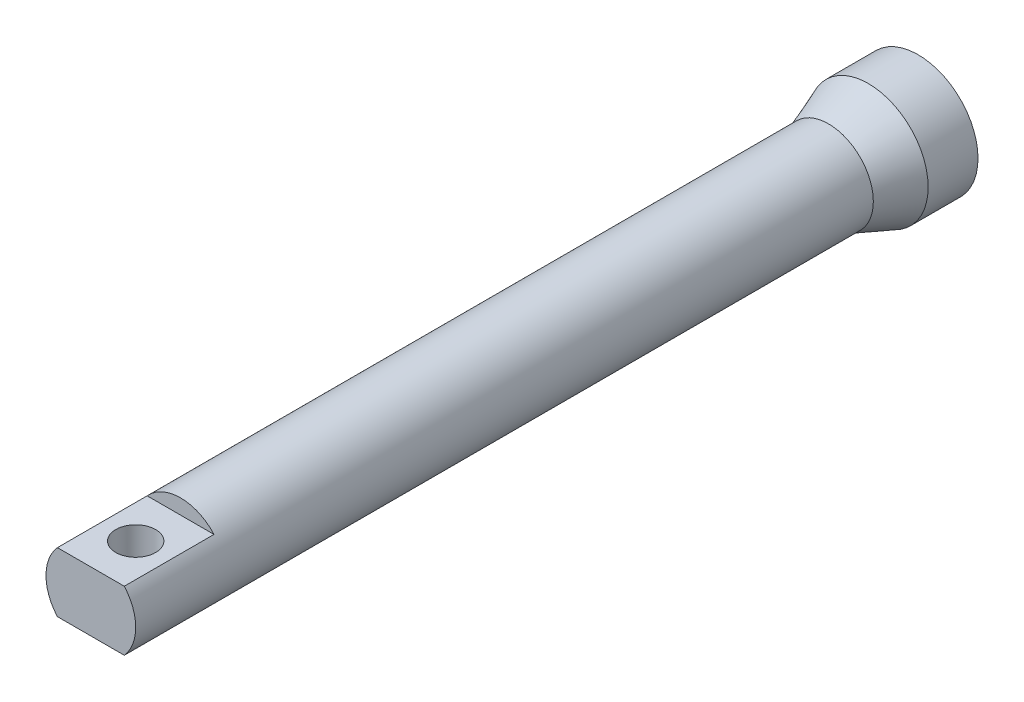
ISO-10303-21;
HEADER;
FILE_DESCRIPTION(('STEP AP214'),'2;1');
FILE_NAME('part.step','',(''),(''),'','','');
FILE_SCHEMA(('AUTOMOTIVE_DESIGN { 1 0 10303 214 1 1 1 1 }'));
ENDSEC;
DATA;
#1=APPLICATION_CONTEXT('core data for automotive mechanical design processes');
#2=APPLICATION_PROTOCOL_DEFINITION('international standard','automotive_design',2000,#1);
#3=PRODUCT_CONTEXT('',#1,'mechanical');
#4=PRODUCT('Part','Part','',(#3));
#5=PRODUCT_RELATED_PRODUCT_CATEGORY('part','',(#4));
#6=PRODUCT_DEFINITION_FORMATION('','',#4);
#7=PRODUCT_DEFINITION_CONTEXT('part definition',#1,'design');
#8=PRODUCT_DEFINITION('design','',#6,#7);
#9=PRODUCT_DEFINITION_SHAPE('','',#8);
#10=(LENGTH_UNIT() NAMED_UNIT(*) SI_UNIT(.MILLI.,.METRE.));
#11=(NAMED_UNIT(*) PLANE_ANGLE_UNIT() SI_UNIT($,.RADIAN.));
#12=(NAMED_UNIT(*) SI_UNIT($,.STERADIAN.) SOLID_ANGLE_UNIT());
#13=UNCERTAINTY_MEASURE_WITH_UNIT(LENGTH_MEASURE(1.E-05),#10,'distance_accuracy_value','');
#14=(GEOMETRIC_REPRESENTATION_CONTEXT(3) GLOBAL_UNCERTAINTY_ASSIGNED_CONTEXT((#13)) GLOBAL_UNIT_ASSIGNED_CONTEXT((#10,
#11,#12)) REPRESENTATION_CONTEXT('',''));
#15=CARTESIAN_POINT('',(0.,0.,0.));
#16=DIRECTION('',(0.,0.,1.));
#17=DIRECTION('',(1.,0.,0.));
#18=AXIS2_PLACEMENT_3D('',#15,#16,#17);
#19=CARTESIAN_POINT('',(-30.,0.,0.));
#20=DIRECTION('',(0.,0.,1.));
#21=DIRECTION('',(1.,0.,0.));
#22=AXIS2_PLACEMENT_3D('',#19,#20,#21);
#23=PLANE('',#22);
#24=CARTESIAN_POINT('',(0.,0.,0.));
#25=DIRECTION('',(0.,0.,1.));
#26=DIRECTION('',(1.,0.,0.));
#27=AXIS2_PLACEMENT_3D('',#24,#25,#26);
#28=CIRCLE('',#27,30.);
#29=CARTESIAN_POINT('',(30.,0.,0.));
#30=VERTEX_POINT('',#29);
#31=EDGE_CURVE('E117',#30,#30,#28,.T.);
#32=ORIENTED_EDGE('',*,*,#31,.F.);
#33=EDGE_LOOP('',(#32));
#34=FACE_BOUND('',#33,.T.);
#35=CARTESIAN_POINT('',(0.,0.,0.));
#36=DIRECTION('',(0.,0.,1.));
#37=DIRECTION('',(1.,0.,0.));
#38=AXIS2_PLACEMENT_3D('',#35,#36,#37);
#39=CIRCLE('',#38,25.);
#40=CARTESIAN_POINT('',(25.,0.,0.));
#41=VERTEX_POINT('',#40);
#42=EDGE_CURVE('E129',#41,#41,#39,.T.);
#43=ORIENTED_EDGE('',*,*,#42,.T.);
#44=EDGE_LOOP('',(#43));
#45=FACE_BOUND('',#44,.T.);
#46=ADVANCED_FACE('F39',(#34,#45),#23,.F.);
#47=CARTESIAN_POINT('',(0.,0.,47.25));
#48=DIRECTION('',(0.,0.,1.));
#49=DIRECTION('',(1.,0.,0.));
#50=AXIS2_PLACEMENT_3D('',#47,#48,#49);
#51=CYLINDRICAL_SURFACE('',#50,25.);
#52=ORIENTED_EDGE('',*,*,#42,.F.);
#53=EDGE_LOOP('',(#52));
#54=FACE_BOUND('',#53,.T.);
#55=CARTESIAN_POINT('',(0.,0.,25.));
#56=DIRECTION('',(0.,0.,1.));
#57=DIRECTION('',(1.,0.,0.));
#58=AXIS2_PLACEMENT_3D('',#55,#56,#57);
#59=CIRCLE('',#58,25.);
#60=CARTESIAN_POINT('',(25.,0.,25.));
#61=VERTEX_POINT('',#60);
#62=EDGE_CURVE('E126',#61,#61,#59,.T.);
#63=ORIENTED_EDGE('',*,*,#62,.T.);
#64=EDGE_LOOP('',(#63));
#65=FACE_BOUND('',#64,.T.);
#66=ADVANCED_FACE('F158',(#54,#65),#51,.F.);
#67=CARTESIAN_POINT('',(0.,0.,45.));
#68=DIRECTION('',(0.,0.,-1.));
#69=DIRECTION('',(-1.,0.,0.));
#70=AXIS2_PLACEMENT_3D('',#67,#68,#69);
#71=CONICAL_SURFACE('',#70,17.5,0.358770670270572);
#72=ORIENTED_EDGE('',*,*,#62,.F.);
#73=EDGE_LOOP('',(#72));
#74=FACE_BOUND('',#73,.T.);
#75=CARTESIAN_POINT('',(0.,0.,45.));
#76=DIRECTION('',(0.,0.,1.));
#77=DIRECTION('',(1.,0.,0.));
#78=AXIS2_PLACEMENT_3D('',#75,#76,#77);
#79=CIRCLE('',#78,17.5);
#80=CARTESIAN_POINT('',(17.5,0.,45.));
#81=VERTEX_POINT('',#80);
#82=EDGE_CURVE('E114',#81,#81,#79,.T.);
#83=ORIENTED_EDGE('',*,*,#82,.T.);
#84=EDGE_LOOP('',(#83));
#85=FACE_BOUND('',#84,.T.);
#86=ADVANCED_FACE('F163',(#74,#85),#71,.F.);
#87=CARTESIAN_POINT('',(0.,0.,25.));
#88=DIRECTION('',(0.,0.,-1.));
#89=DIRECTION('',(-1.,0.,0.));
#90=AXIS2_PLACEMENT_3D('',#87,#88,#89);
#91=CONICAL_SURFACE('',#90,30.,0.358770670270572);
#92=CARTESIAN_POINT('',(0.,0.,45.));
#93=DIRECTION('',(0.,0.,1.));
#94=DIRECTION('',(1.,0.,0.));
#95=AXIS2_PLACEMENT_3D('',#92,#93,#94);
#96=CIRCLE('',#95,22.5);
#97=CARTESIAN_POINT('',(22.5,0.,45.));
#98=VERTEX_POINT('',#97);
#99=EDGE_CURVE('E123',#98,#98,#96,.T.);
#100=ORIENTED_EDGE('',*,*,#99,.F.);
#101=EDGE_LOOP('',(#100));
#102=FACE_BOUND('',#101,.T.);
#103=CARTESIAN_POINT('',(0.,0.,25.));
#104=DIRECTION('',(0.,0.,1.));
#105=DIRECTION('',(1.,0.,0.));
#106=AXIS2_PLACEMENT_3D('',#103,#104,#105);
#107=CIRCLE('',#106,30.);
#108=CARTESIAN_POINT('',(30.,0.,25.));
#109=VERTEX_POINT('',#108);
#110=EDGE_CURVE('E120',#109,#109,#107,.T.);
#111=ORIENTED_EDGE('',*,*,#110,.T.);
#112=EDGE_LOOP('',(#111));
#113=FACE_BOUND('',#112,.T.);
#114=ADVANCED_FACE('F173',(#102,#113),#91,.T.);
#115=CARTESIAN_POINT('',(0.,0.,47.25));
#116=DIRECTION('',(0.,0.,1.));
#117=DIRECTION('',(1.,0.,0.));
#118=AXIS2_PLACEMENT_3D('',#115,#116,#117);
#119=CYLINDRICAL_SURFACE('',#118,30.);
#120=ORIENTED_EDGE('',*,*,#110,.F.);
#121=EDGE_LOOP('',(#120));
#122=FACE_BOUND('',#121,.T.);
#123=ORIENTED_EDGE('',*,*,#31,.T.);
#124=EDGE_LOOP('',(#123));
#125=FACE_BOUND('',#124,.T.);
#126=ADVANCED_FACE('F188',(#122,#125),#119,.T.);
#127=CARTESIAN_POINT('',(0.,0.,365.));
#128=DIRECTION('',(0.,0.,-1.));
#129=DIRECTION('',(-1.,0.,0.));
#130=AXIS2_PLACEMENT_3D('',#127,#128,#129);
#131=CYLINDRICAL_SURFACE('',#130,22.5);
#132=CARTESIAN_POINT('',(0.,0.,370.));
#133=DIRECTION('',(0.,0.,1.));
#134=DIRECTION('',(1.,0.,0.));
#135=AXIS2_PLACEMENT_3D('',#132,#133,#134);
#136=CIRCLE('',#135,22.5);
#137=CARTESIAN_POINT('',(16.7705098312484,15.,370.));
#138=VERTEX_POINT('',#137);
#139=CARTESIAN_POINT('',(-16.7705098312484,15.,370.));
#140=VERTEX_POINT('',#139);
#141=EDGE_CURVE('E11',#138,#140,#136,.T.);
#142=ORIENTED_EDGE('',*,*,#141,.F.);
#143=DIRECTION('',(0.,0.,1.));
#144=VECTOR('',#143,1.);
#145=CARTESIAN_POINT('',(16.7705098312484,15.,370.));
#146=LINE('',#145,#144);
#147=CARTESIAN_POINT('',(16.7705098312484,15.,415.));
#148=VERTEX_POINT('',#147);
#149=EDGE_CURVE('E86',#138,#148,#146,.T.);
#150=ORIENTED_EDGE('',*,*,#149,.T.);
#151=CARTESIAN_POINT('',(0.,0.,415.));
#152=DIRECTION('',(0.,0.,1.));
#153=DIRECTION('',(1.,0.,0.));
#154=AXIS2_PLACEMENT_3D('',#151,#152,#153);
#155=CIRCLE('',#154,22.5);
#156=CARTESIAN_POINT('',(16.7705098312484,-15.,415.));
#157=VERTEX_POINT('',#156);
#158=EDGE_CURVE('E96',#157,#148,#155,.T.);
#159=ORIENTED_EDGE('',*,*,#158,.F.);
#160=DIRECTION('',(0.,0.,1.));
#161=VECTOR('',#160,1.);
#162=CARTESIAN_POINT('',(16.7705098312484,-15.,370.));
#163=LINE('',#162,#161);
#164=CARTESIAN_POINT('',(16.7705098312484,-15.,370.));
#165=VERTEX_POINT('',#164);
#166=EDGE_CURVE('E54',#165,#157,#163,.T.);
#167=ORIENTED_EDGE('',*,*,#166,.F.);
#168=CARTESIAN_POINT('',(0.,0.,370.));
#169=DIRECTION('',(0.,0.,-1.));
#170=DIRECTION('',(-1.,0.,0.));
#171=AXIS2_PLACEMENT_3D('',#168,#169,#170);
#172=CIRCLE('',#171,22.5);
#173=CARTESIAN_POINT('',(-16.7705098312484,-15.,370.));
#174=VERTEX_POINT('',#173);
#175=EDGE_CURVE('E47',#165,#174,#172,.T.);
#176=ORIENTED_EDGE('',*,*,#175,.T.);
#177=DIRECTION('',(0.,0.,1.));
#178=VECTOR('',#177,1.);
#179=CARTESIAN_POINT('',(-16.7705098312484,-15.,370.));
#180=LINE('',#179,#178);
#181=CARTESIAN_POINT('',(-16.7705098312484,-15.,415.));
#182=VERTEX_POINT('',#181);
#183=EDGE_CURVE('E106',#174,#182,#180,.T.);
#184=ORIENTED_EDGE('',*,*,#183,.T.);
#185=CARTESIAN_POINT('',(-16.7705098312484,15.,415.));
#186=VERTEX_POINT('',#185);
#187=EDGE_CURVE('E94',#186,#182,#155,.T.);
#188=ORIENTED_EDGE('',*,*,#187,.F.);
#189=DIRECTION('',(0.,0.,1.));
#190=VECTOR('',#189,1.);
#191=CARTESIAN_POINT('',(-16.7705098312484,15.,370.));
#192=LINE('',#191,#190);
#193=EDGE_CURVE('E62',#140,#186,#192,.T.);
#194=ORIENTED_EDGE('',*,*,#193,.F.);
#195=EDGE_LOOP('',(#142,#150,#159,#167,#176,#184,#188,#194));
#196=FACE_BOUND('',#195,.T.);
#197=ORIENTED_EDGE('',*,*,#99,.T.);
#198=EDGE_LOOP('',(#197));
#199=FACE_BOUND('',#198,.T.);
#200=ADVANCED_FACE('F90',(#196,#199),#131,.T.);
#201=CARTESIAN_POINT('',(0.,0.,365.));
#202=DIRECTION('',(0.,0.,-1.));
#203=DIRECTION('',(-1.,0.,0.));
#204=AXIS2_PLACEMENT_3D('',#201,#202,#203);
#205=CYLINDRICAL_SURFACE('',#204,17.5);
#206=CARTESIAN_POINT('',(0.,0.,365.));
#207=DIRECTION('',(0.,0.,1.));
#208=DIRECTION('',(1.,0.,0.));
#209=AXIS2_PLACEMENT_3D('',#206,#207,#208);
#210=CIRCLE('',#209,17.5);
#211=CARTESIAN_POINT('',(17.5,0.,365.));
#212=VERTEX_POINT('',#211);
#213=EDGE_CURVE('E111',#212,#212,#210,.T.);
#214=ORIENTED_EDGE('',*,*,#213,.T.);
#215=EDGE_LOOP('',(#214));
#216=FACE_BOUND('',#215,.T.);
#217=ORIENTED_EDGE('',*,*,#82,.F.);
#218=EDGE_LOOP('',(#217));
#219=FACE_BOUND('',#218,.T.);
#220=ADVANCED_FACE('F177',(#216,#219),#205,.F.);
#221=CARTESIAN_POINT('',(0.,0.,365.));
#222=DIRECTION('',(0.,0.,1.));
#223=DIRECTION('',(1.,0.,0.));
#224=AXIS2_PLACEMENT_3D('',#221,#222,#223);
#225=PLANE('',#224);
#226=ORIENTED_EDGE('',*,*,#213,.F.);
#227=EDGE_LOOP('',(#226));
#228=FACE_BOUND('',#227,.T.);
#229=ADVANCED_FACE('F179',(#228),#225,.F.);
#230=CARTESIAN_POINT('',(0.,0.,415.));
#231=DIRECTION('',(0.,0.,1.));
#232=DIRECTION('',(1.,0.,0.));
#233=AXIS2_PLACEMENT_3D('',#230,#231,#232);
#234=PLANE('',#233);
#235=DIRECTION('',(1.,0.,0.));
#236=VECTOR('',#235,1.);
#237=CARTESIAN_POINT('',(16.7705098312484,15.,415.));
#238=LINE('',#237,#236);
#239=EDGE_CURVE('E87',#186,#148,#238,.T.);
#240=ORIENTED_EDGE('',*,*,#239,.F.);
#241=ORIENTED_EDGE('',*,*,#187,.T.);
#242=DIRECTION('',(-1.,0.,0.));
#243=VECTOR('',#242,1.);
#244=CARTESIAN_POINT('',(16.7705098312484,-15.,415.));
#245=LINE('',#244,#243);
#246=EDGE_CURVE('E103',#157,#182,#245,.T.);
#247=ORIENTED_EDGE('',*,*,#246,.F.);
#248=ORIENTED_EDGE('',*,*,#158,.T.);
#249=EDGE_LOOP('',(#240,#241,#247,#248));
#250=FACE_BOUND('',#249,.T.);
#251=ADVANCED_FACE('F138',(#250),#234,.T.);
#252=CARTESIAN_POINT('',(0.,0.,370.));
#253=DIRECTION('',(0.,0.,-1.));
#254=DIRECTION('',(-1.,0.,0.));
#255=AXIS2_PLACEMENT_3D('',#252,#253,#254);
#256=PLANE('',#255);
#257=DIRECTION('',(-1.,0.,0.));
#258=VECTOR('',#257,1.);
#259=CARTESIAN_POINT('',(16.7705098312484,-15.,370.));
#260=LINE('',#259,#258);
#261=EDGE_CURVE('E100',#165,#174,#260,.T.);
#262=ORIENTED_EDGE('',*,*,#261,.T.);
#263=ORIENTED_EDGE('',*,*,#175,.F.);
#264=EDGE_LOOP('',(#262,#263));
#265=FACE_BOUND('',#264,.T.);
#266=ADVANCED_FACE('F135',(#265),#256,.F.);
#267=CARTESIAN_POINT('',(16.7705098312484,-15.,370.));
#268=DIRECTION('',(0.,1.,0.));
#269=DIRECTION('',(-1.,0.,0.));
#270=AXIS2_PLACEMENT_3D('',#267,#268,#269);
#271=PLANE('',#270);
#272=CARTESIAN_POINT('',(0.,-15.,392.5));
#273=DIRECTION('',(0.,1.,0.));
#274=DIRECTION('',(-1.,0.,0.));
#275=AXIS2_PLACEMENT_3D('',#272,#273,#274);
#276=CIRCLE('',#275,10.);
#277=CARTESIAN_POINT('',(-10.,-15.,392.5));
#278=VERTEX_POINT('',#277);
#279=EDGE_CURVE('E105',#278,#278,#276,.T.);
#280=ORIENTED_EDGE('',*,*,#279,.T.);
#281=EDGE_LOOP('',(#280));
#282=FACE_BOUND('',#281,.T.);
#283=ORIENTED_EDGE('',*,*,#246,.T.);
#284=ORIENTED_EDGE('',*,*,#183,.F.);
#285=ORIENTED_EDGE('',*,*,#261,.F.);
#286=ORIENTED_EDGE('',*,*,#166,.T.);
#287=EDGE_LOOP('',(#283,#284,#285,#286));
#288=FACE_BOUND('',#287,.T.);
#289=ADVANCED_FACE('F136',(#282,#288),#271,.F.);
#290=CARTESIAN_POINT('',(0.,0.,370.));
#291=DIRECTION('',(0.,0.,1.));
#292=DIRECTION('',(1.,0.,0.));
#293=AXIS2_PLACEMENT_3D('',#290,#291,#292);
#294=PLANE('',#293);
#295=ORIENTED_EDGE('',*,*,#141,.T.);
#296=DIRECTION('',(1.,0.,0.));
#297=VECTOR('',#296,1.);
#298=CARTESIAN_POINT('',(16.7705098312484,15.,370.));
#299=LINE('',#298,#297);
#300=EDGE_CURVE('E82',#140,#138,#299,.T.);
#301=ORIENTED_EDGE('',*,*,#300,.T.);
#302=EDGE_LOOP('',(#295,#301));
#303=FACE_BOUND('',#302,.T.);
#304=ADVANCED_FACE('F81',(#303),#294,.T.);
#305=CARTESIAN_POINT('',(16.7705098312484,15.,370.));
#306=DIRECTION('',(0.,-1.,0.));
#307=DIRECTION('',(1.,0.,0.));
#308=AXIS2_PLACEMENT_3D('',#305,#306,#307);
#309=PLANE('',#308);
#310=CARTESIAN_POINT('',(0.,15.,392.5));
#311=DIRECTION('',(0.,-1.,0.));
#312=DIRECTION('',(1.,0.,0.));
#313=AXIS2_PLACEMENT_3D('',#310,#311,#312);
#314=CIRCLE('',#313,10.);
#315=CARTESIAN_POINT('',(10.,15.,392.5));
#316=VERTEX_POINT('',#315);
#317=EDGE_CURVE('E42',#316,#316,#314,.T.);
#318=ORIENTED_EDGE('',*,*,#317,.T.);
#319=EDGE_LOOP('',(#318));
#320=FACE_BOUND('',#319,.T.);
#321=ORIENTED_EDGE('',*,*,#239,.T.);
#322=ORIENTED_EDGE('',*,*,#149,.F.);
#323=ORIENTED_EDGE('',*,*,#300,.F.);
#324=ORIENTED_EDGE('',*,*,#193,.T.);
#325=EDGE_LOOP('',(#321,#322,#323,#324));
#326=FACE_BOUND('',#325,.T.);
#327=ADVANCED_FACE('F85',(#320,#326),#309,.F.);
#328=CARTESIAN_POINT('',(0.,-30.,392.5));
#329=DIRECTION('',(0.,1.,0.));
#330=DIRECTION('',(-1.,0.,0.));
#331=AXIS2_PLACEMENT_3D('',#328,#329,#330);
#332=CYLINDRICAL_SURFACE('',#331,10.);
#333=ORIENTED_EDGE('',*,*,#317,.F.);
#334=EDGE_LOOP('',(#333));
#335=FACE_BOUND('',#334,.T.);
#336=ORIENTED_EDGE('',*,*,#279,.F.);
#337=EDGE_LOOP('',(#336));
#338=FACE_BOUND('',#337,.T.);
#339=ADVANCED_FACE('F147',(#335,#338),#332,.F.);
#340=CLOSED_SHELL('',(#46,#66,#86,#114,#126,#200,#220,#229,#251,#266,#289,#304,#327,#339));
#341=MANIFOLD_SOLID_BREP('B2',#340);
#342=ADVANCED_BREP_SHAPE_REPRESENTATION('',(#18,#341),#14);
#343=SHAPE_DEFINITION_REPRESENTATION(#9,#342);
ENDSEC;
END-ISO-10303-21;
